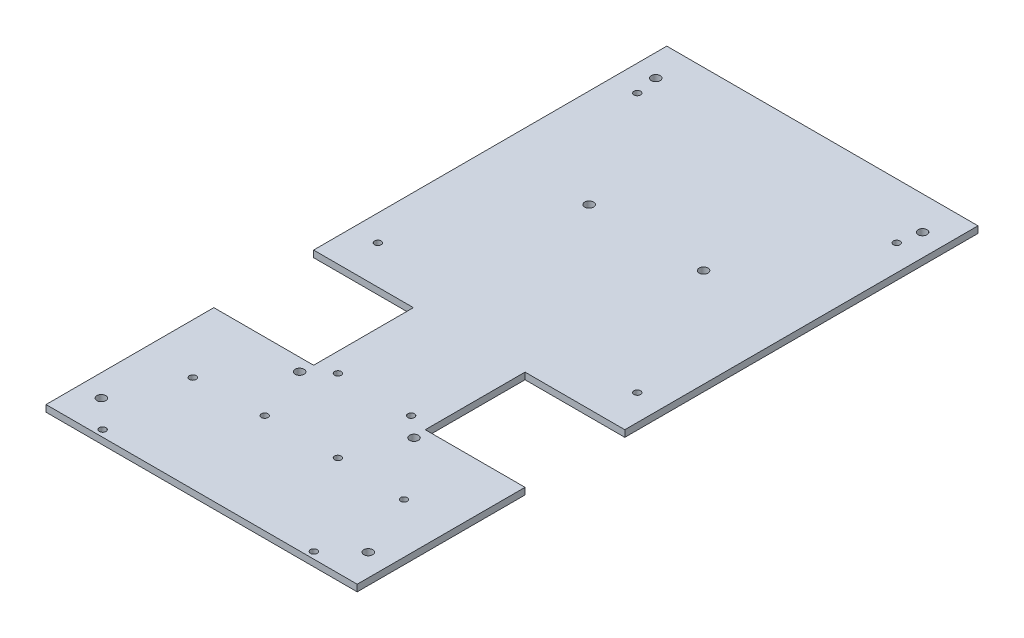
ISO-10303-21;
HEADER;
FILE_DESCRIPTION(('STEP AP214'),'2;1');
FILE_NAME('part.step','',(''),(''),'','','');
FILE_SCHEMA(('AUTOMOTIVE_DESIGN { 1 0 10303 214 1 1 1 1 }'));
ENDSEC;
DATA;
#1=APPLICATION_CONTEXT('core data for automotive mechanical design processes');
#2=APPLICATION_PROTOCOL_DEFINITION('international standard','automotive_design',2000,#1);
#3=PRODUCT_CONTEXT('',#1,'mechanical');
#4=PRODUCT('Part','Part','',(#3));
#5=PRODUCT_RELATED_PRODUCT_CATEGORY('part','',(#4));
#6=PRODUCT_DEFINITION_FORMATION('','',#4);
#7=PRODUCT_DEFINITION_CONTEXT('part definition',#1,'design');
#8=PRODUCT_DEFINITION('design','',#6,#7);
#9=PRODUCT_DEFINITION_SHAPE('','',#8);
#10=(LENGTH_UNIT() NAMED_UNIT(*) SI_UNIT(.MILLI.,.METRE.));
#11=(NAMED_UNIT(*) PLANE_ANGLE_UNIT() SI_UNIT($,.RADIAN.));
#12=(NAMED_UNIT(*) SI_UNIT($,.STERADIAN.) SOLID_ANGLE_UNIT());
#13=UNCERTAINTY_MEASURE_WITH_UNIT(LENGTH_MEASURE(1.E-05),#10,'distance_accuracy_value','');
#14=(GEOMETRIC_REPRESENTATION_CONTEXT(3) GLOBAL_UNCERTAINTY_ASSIGNED_CONTEXT((#13)) GLOBAL_UNIT_ASSIGNED_CONTEXT((#10,
#11,#12)) REPRESENTATION_CONTEXT('',''));
#15=CARTESIAN_POINT('',(0.,0.,0.));
#16=DIRECTION('',(0.,0.,1.));
#17=DIRECTION('',(1.,0.,0.));
#18=AXIS2_PLACEMENT_3D('',#15,#16,#17);
#19=CARTESIAN_POINT('',(0.,3.,0.));
#20=DIRECTION('',(0.,1.,0.));
#21=DIRECTION('',(0.,0.,1.));
#22=AXIS2_PLACEMENT_3D('',#19,#20,#21);
#23=PLANE('',#22);
#24=CARTESIAN_POINT('',(-74.2953937007874,3.,164.952755905512));
#25=DIRECTION('',(0.,1.,0.));
#26=DIRECTION('',(0.,0.,1.));
#27=AXIS2_PLACEMENT_3D('',#24,#25,#26);
#28=CIRCLE('',#27,1.5);
#29=CARTESIAN_POINT('',(-74.2953937007874,3.,166.452755905512));
#30=VERTEX_POINT('',#29);
#31=EDGE_CURVE('E363',#30,#30,#28,.T.);
#32=ORIENTED_EDGE('',*,*,#31,.F.);
#33=EDGE_LOOP('',(#32));
#34=FACE_BOUND('',#33,.T.);
#35=CARTESIAN_POINT('',(20.9546062992127,3.,164.952755905512));
#36=DIRECTION('',(0.,1.,0.));
#37=DIRECTION('',(0.,0.,1.));
#38=AXIS2_PLACEMENT_3D('',#35,#36,#37);
#39=CIRCLE('',#38,1.5);
#40=CARTESIAN_POINT('',(20.9546062992127,3.,166.452755905512));
#41=VERTEX_POINT('',#40);
#42=EDGE_CURVE('E357',#41,#41,#39,.T.);
#43=ORIENTED_EDGE('',*,*,#42,.F.);
#44=EDGE_LOOP('',(#43));
#45=FACE_BOUND('',#44,.T.);
#46=CARTESIAN_POINT('',(20.9546062992126,3.,124.312755905512));
#47=DIRECTION('',(0.,1.,0.));
#48=DIRECTION('',(0.,0.,1.));
#49=AXIS2_PLACEMENT_3D('',#46,#47,#48);
#50=CIRCLE('',#49,1.5);
#51=CARTESIAN_POINT('',(20.9546062992126,3.,125.812755905512));
#52=VERTEX_POINT('',#51);
#53=EDGE_CURVE('E351',#52,#52,#50,.T.);
#54=ORIENTED_EDGE('',*,*,#53,.F.);
#55=EDGE_LOOP('',(#54));
#56=FACE_BOUND('',#55,.T.);
#57=CARTESIAN_POINT('',(-74.2953937007874,3.,124.312755905512));
#58=DIRECTION('',(0.,1.,0.));
#59=DIRECTION('',(0.,0.,1.));
#60=AXIS2_PLACEMENT_3D('',#57,#58,#59);
#61=CIRCLE('',#60,1.5);
#62=CARTESIAN_POINT('',(-74.2953937007874,3.,125.812755905512));
#63=VERTEX_POINT('',#62);
#64=EDGE_CURVE('E345',#63,#63,#61,.T.);
#65=ORIENTED_EDGE('',*,*,#64,.F.);
#66=EDGE_LOOP('',(#65));
#67=FACE_BOUND('',#66,.T.);
#68=CARTESIAN_POINT('',(-52.4703937007874,3.,-32.6472440944882));
#69=DIRECTION('',(0.,1.,0.));
#70=DIRECTION('',(0.,0.,1.));
#71=AXIS2_PLACEMENT_3D('',#68,#69,#70);
#72=CIRCLE('',#71,2.);
#73=CARTESIAN_POINT('',(-52.4703937007874,3.,-30.6472440944882));
#74=VERTEX_POINT('',#73);
#75=EDGE_CURVE('E339',#74,#74,#72,.T.);
#76=ORIENTED_EDGE('',*,*,#75,.F.);
#77=EDGE_LOOP('',(#76));
#78=FACE_BOUND('',#77,.T.);
#79=CARTESIAN_POINT('',(-0.870393700787378,3.,-32.6472440944882));
#80=DIRECTION('',(0.,1.,0.));
#81=DIRECTION('',(0.,0.,1.));
#82=AXIS2_PLACEMENT_3D('',#79,#80,#81);
#83=CIRCLE('',#82,2.);
#84=CARTESIAN_POINT('',(-0.870393700787378,3.,-30.6472440944882));
#85=VERTEX_POINT('',#84);
#86=EDGE_CURVE('E333',#85,#85,#83,.T.);
#87=ORIENTED_EDGE('',*,*,#86,.F.);
#88=EDGE_LOOP('',(#87));
#89=FACE_BOUND('',#88,.T.);
#90=CARTESIAN_POINT('',(-43.1803937007874,3.,122.972755905512));
#91=DIRECTION('',(0.,1.,0.));
#92=DIRECTION('',(0.,0.,1.));
#93=AXIS2_PLACEMENT_3D('',#90,#91,#92);
#94=CIRCLE('',#93,1.5);
#95=CARTESIAN_POINT('',(-43.1803937007874,3.,124.472755905512));
#96=VERTEX_POINT('',#95);
#97=EDGE_CURVE('E327',#96,#96,#94,.T.);
#98=ORIENTED_EDGE('',*,*,#97,.F.);
#99=EDGE_LOOP('',(#98));
#100=FACE_BOUND('',#99,.T.);
#101=CARTESIAN_POINT('',(-10.1603937007874,3.,122.972755905512));
#102=DIRECTION('',(0.,1.,0.));
#103=DIRECTION('',(0.,0.,1.));
#104=AXIS2_PLACEMENT_3D('',#101,#102,#103);
#105=CIRCLE('',#104,1.5);
#106=CARTESIAN_POINT('',(-10.1603937007874,3.,124.472755905512));
#107=VERTEX_POINT('',#106);
#108=EDGE_CURVE('E321',#107,#107,#105,.T.);
#109=ORIENTED_EDGE('',*,*,#108,.F.);
#110=EDGE_LOOP('',(#109));
#111=FACE_BOUND('',#110,.T.);
#112=CARTESIAN_POINT('',(-10.1603937007874,3.,89.9527559055118));
#113=DIRECTION('',(0.,1.,0.));
#114=DIRECTION('',(0.,0.,1.));
#115=AXIS2_PLACEMENT_3D('',#112,#113,#114);
#116=CIRCLE('',#115,1.5);
#117=CARTESIAN_POINT('',(-10.1603937007874,3.,91.4527559055118));
#118=VERTEX_POINT('',#117);
#119=EDGE_CURVE('E315',#118,#118,#116,.T.);
#120=ORIENTED_EDGE('',*,*,#119,.F.);
#121=EDGE_LOOP('',(#120));
#122=FACE_BOUND('',#121,.T.);
#123=CARTESIAN_POINT('',(-43.1803937007874,3.,89.9527559055118));
#124=DIRECTION('',(0.,1.,0.));
#125=DIRECTION('',(0.,0.,1.));
#126=AXIS2_PLACEMENT_3D('',#123,#124,#125);
#127=CIRCLE('',#126,1.5);
#128=CARTESIAN_POINT('',(-43.1803937007874,3.,91.4527559055118));
#129=VERTEX_POINT('',#128);
#130=EDGE_CURVE('E309',#129,#129,#127,.T.);
#131=ORIENTED_EDGE('',*,*,#130,.F.);
#132=EDGE_LOOP('',(#131));
#133=FACE_BOUND('',#132,.T.);
#134=CARTESIAN_POINT('',(-0.870393700787356,3.,97.9527559055118));
#135=DIRECTION('',(0.,1.,0.));
#136=DIRECTION('',(0.,0.,1.));
#137=AXIS2_PLACEMENT_3D('',#134,#135,#136);
#138=CIRCLE('',#137,2.);
#139=CARTESIAN_POINT('',(-0.870393700787356,3.,99.9527559055118));
#140=VERTEX_POINT('',#139);
#141=EDGE_CURVE('E303',#140,#140,#138,.T.);
#142=ORIENTED_EDGE('',*,*,#141,.F.);
#143=EDGE_LOOP('',(#142));
#144=FACE_BOUND('',#143,.T.);
#145=CARTESIAN_POINT('',(-52.4703937007874,3.,97.9527559055118));
#146=DIRECTION('',(0.,1.,0.));
#147=DIRECTION('',(0.,0.,1.));
#148=AXIS2_PLACEMENT_3D('',#145,#146,#147);
#149=CIRCLE('',#148,2.);
#150=CARTESIAN_POINT('',(-52.4703937007874,3.,99.9527559055118));
#151=VERTEX_POINT('',#150);
#152=EDGE_CURVE('E297',#151,#151,#149,.T.);
#153=ORIENTED_EDGE('',*,*,#152,.F.);
#154=EDGE_LOOP('',(#153));
#155=FACE_BOUND('',#154,.T.);
#156=CARTESIAN_POINT('',(31.8296062992126,3.,-87.0472440944882));
#157=DIRECTION('',(0.,1.,0.));
#158=DIRECTION('',(0.,0.,1.));
#159=AXIS2_PLACEMENT_3D('',#156,#157,#158);
#160=CIRCLE('',#159,1.5);
#161=CARTESIAN_POINT('',(31.8296062992126,3.,-85.5472440944882));
#162=VERTEX_POINT('',#161);
#163=EDGE_CURVE('E291',#162,#162,#160,.T.);
#164=ORIENTED_EDGE('',*,*,#163,.F.);
#165=EDGE_LOOP('',(#164));
#166=FACE_BOUND('',#165,.T.);
#167=CARTESIAN_POINT('',(31.8296062992126,3.,29.9527559055118));
#168=DIRECTION('',(0.,1.,0.));
#169=DIRECTION('',(0.,0.,1.));
#170=AXIS2_PLACEMENT_3D('',#167,#168,#169);
#171=CIRCLE('',#170,1.5);
#172=CARTESIAN_POINT('',(31.8296062992126,3.,31.4527559055118));
#173=VERTEX_POINT('',#172);
#174=EDGE_CURVE('E285',#173,#173,#171,.T.);
#175=ORIENTED_EDGE('',*,*,#174,.F.);
#176=EDGE_LOOP('',(#175));
#177=FACE_BOUND('',#176,.T.);
#178=CARTESIAN_POINT('',(-85.1703937007874,3.,29.9527559055118));
#179=DIRECTION('',(0.,1.,0.));
#180=DIRECTION('',(0.,0.,1.));
#181=AXIS2_PLACEMENT_3D('',#178,#179,#180);
#182=CIRCLE('',#181,1.5);
#183=CARTESIAN_POINT('',(-85.1703937007874,3.,31.4527559055118));
#184=VERTEX_POINT('',#183);
#185=EDGE_CURVE('E280',#184,#184,#182,.T.);
#186=ORIENTED_EDGE('',*,*,#185,.F.);
#187=EDGE_LOOP('',(#186));
#188=FACE_BOUND('',#187,.T.);
#189=CARTESIAN_POINT('',(-85.1703937007874,3.,-87.0472440944882));
#190=DIRECTION('',(0.,1.,0.));
#191=DIRECTION('',(0.,0.,1.));
#192=AXIS2_PLACEMENT_3D('',#189,#190,#191);
#193=CIRCLE('',#192,1.5);
#194=CARTESIAN_POINT('',(-85.1703937007874,3.,-85.5472440944882));
#195=VERTEX_POINT('',#194);
#196=EDGE_CURVE('E185',#195,#195,#193,.T.);
#197=ORIENTED_EDGE('',*,*,#196,.F.);
#198=EDGE_LOOP('',(#197));
#199=FACE_BOUND('',#198,.T.);
#200=CARTESIAN_POINT('',(33.5096062992126,3.,-97.0472440944882));
#201=DIRECTION('',(0.,1.,0.));
#202=DIRECTION('',(0.,0.,1.));
#203=AXIS2_PLACEMENT_3D('',#200,#201,#202);
#204=CIRCLE('',#203,2.);
#205=CARTESIAN_POINT('',(33.5096062992126,3.,-95.0472440944882));
#206=VERTEX_POINT('',#205);
#207=EDGE_CURVE('E221',#206,#206,#204,.T.);
#208=ORIENTED_EDGE('',*,*,#207,.F.);
#209=EDGE_LOOP('',(#208));
#210=FACE_BOUND('',#209,.T.);
#211=CARTESIAN_POINT('',(-86.8503937007874,3.,-97.0472440944882));
#212=DIRECTION('',(0.,1.,0.));
#213=DIRECTION('',(0.,0.,-1.));
#214=AXIS2_PLACEMENT_3D('',#211,#212,#213);
#215=CIRCLE('',#214,2.);
#216=CARTESIAN_POINT('',(-86.8503937007874,3.,-99.0472440944882));
#217=VERTEX_POINT('',#216);
#218=EDGE_CURVE('E225',#217,#217,#215,.T.);
#219=ORIENTED_EDGE('',*,*,#218,.F.);
#220=EDGE_LOOP('',(#219));
#221=FACE_BOUND('',#220,.T.);
#222=CARTESIAN_POINT('',(33.5096062992126,3.,152.952755905512));
#223=DIRECTION('',(0.,1.,0.));
#224=DIRECTION('',(0.,0.,-1.));
#225=AXIS2_PLACEMENT_3D('',#222,#223,#224);
#226=CIRCLE('',#225,2.);
#227=CARTESIAN_POINT('',(33.5096062992126,3.,150.952755905512));
#228=VERTEX_POINT('',#227);
#229=EDGE_CURVE('E231',#228,#228,#226,.T.);
#230=ORIENTED_EDGE('',*,*,#229,.F.);
#231=EDGE_LOOP('',(#230));
#232=FACE_BOUND('',#231,.T.);
#233=CARTESIAN_POINT('',(-86.8503937007874,3.,152.952755905512));
#234=DIRECTION('',(0.,1.,0.));
#235=DIRECTION('',(0.,0.,1.));
#236=AXIS2_PLACEMENT_3D('',#233,#234,#235);
#237=CIRCLE('',#236,2.);
#238=CARTESIAN_POINT('',(-86.8503937007874,3.,154.952755905512));
#239=VERTEX_POINT('',#238);
#240=EDGE_CURVE('E237',#239,#239,#237,.T.);
#241=ORIENTED_EDGE('',*,*,#240,.F.);
#242=EDGE_LOOP('',(#241));
#243=FACE_BOUND('',#242,.T.);
#244=DIRECTION('',(0.,0.,-1.));
#245=VECTOR('',#244,1.);
#246=CARTESIAN_POINT('',(43.5096062992126,3.,-112.047244094488));
#247=LINE('',#246,#245);
#248=CARTESIAN_POINT('',(43.5096062992126,3.,167.952755905512));
#249=VERTEX_POINT('',#248);
#250=CARTESIAN_POINT('',(43.5096062992126,3.,92.2527559055118));
#251=VERTEX_POINT('',#250);
#252=EDGE_CURVE('E145',#249,#251,#247,.T.);
#253=ORIENTED_EDGE('',*,*,#252,.T.);
#254=DIRECTION('',(1.,0.,0.));
#255=VECTOR('',#254,1.);
#256=CARTESIAN_POINT('',(43.5096062992126,3.,92.2527559055118));
#257=LINE('',#256,#255);
#258=CARTESIAN_POINT('',(-1.49039370078735,3.,92.2527559055118));
#259=VERTEX_POINT('',#258);
#260=EDGE_CURVE('E127',#259,#251,#257,.T.);
#261=ORIENTED_EDGE('',*,*,#260,.F.);
#262=DIRECTION('',(0.,0.,1.));
#263=VECTOR('',#262,1.);
#264=CARTESIAN_POINT('',(-1.49039370078735,3.,92.2527559055118));
#265=LINE('',#264,#263);
#266=CARTESIAN_POINT('',(-1.49039370078737,3.,47.2527559055118));
#267=VERTEX_POINT('',#266);
#268=EDGE_CURVE('E192',#267,#259,#265,.T.);
#269=ORIENTED_EDGE('',*,*,#268,.F.);
#270=DIRECTION('',(-1.,0.,0.));
#271=VECTOR('',#270,1.);
#272=CARTESIAN_POINT('',(43.5096062992126,3.,47.2527559055118));
#273=LINE('',#272,#271);
#274=CARTESIAN_POINT('',(43.5096062992126,3.,47.2527559055118));
#275=VERTEX_POINT('',#274);
#276=EDGE_CURVE('E137',#275,#267,#273,.T.);
#277=ORIENTED_EDGE('',*,*,#276,.F.);
#278=CARTESIAN_POINT('',(43.5096062992126,3.,-112.047244094488));
#279=VERTEX_POINT('',#278);
#280=EDGE_CURVE('E155',#275,#279,#247,.T.);
#281=ORIENTED_EDGE('',*,*,#280,.T.);
#282=DIRECTION('',(-1.,0.,0.));
#283=VECTOR('',#282,1.);
#284=CARTESIAN_POINT('',(-96.8503937007874,3.,-112.047244094488));
#285=LINE('',#284,#283);
#286=CARTESIAN_POINT('',(-96.8503937007874,3.,-112.047244094488));
#287=VERTEX_POINT('',#286);
#288=EDGE_CURVE('E154',#279,#287,#285,.T.);
#289=ORIENTED_EDGE('',*,*,#288,.T.);
#290=DIRECTION('',(0.,0.,1.));
#291=VECTOR('',#290,1.);
#292=CARTESIAN_POINT('',(-96.8503937007874,3.,-112.047244094488));
#293=LINE('',#292,#291);
#294=CARTESIAN_POINT('',(-96.8503937007874,3.,47.2527559055118));
#295=VERTEX_POINT('',#294);
#296=EDGE_CURVE('E244',#287,#295,#293,.T.);
#297=ORIENTED_EDGE('',*,*,#296,.T.);
#298=DIRECTION('',(-1.,0.,0.));
#299=VECTOR('',#298,1.);
#300=CARTESIAN_POINT('',(-96.8503937007874,3.,47.2527559055118));
#301=LINE('',#300,#299);
#302=CARTESIAN_POINT('',(-51.8503937007874,3.,47.2527559055118));
#303=VERTEX_POINT('',#302);
#304=EDGE_CURVE('E205',#303,#295,#301,.T.);
#305=ORIENTED_EDGE('',*,*,#304,.F.);
#306=DIRECTION('',(0.,0.,-1.));
#307=VECTOR('',#306,1.);
#308=CARTESIAN_POINT('',(-51.8503937007874,3.,92.2527559055118));
#309=LINE('',#308,#307);
#310=CARTESIAN_POINT('',(-51.8503937007874,3.,92.2527559055118));
#311=VERTEX_POINT('',#310);
#312=EDGE_CURVE('E202',#311,#303,#309,.T.);
#313=ORIENTED_EDGE('',*,*,#312,.F.);
#314=DIRECTION('',(1.,0.,0.));
#315=VECTOR('',#314,1.);
#316=CARTESIAN_POINT('',(-96.8503937007874,3.,92.2527559055118));
#317=LINE('',#316,#315);
#318=CARTESIAN_POINT('',(-96.8503937007874,3.,92.2527559055118));
#319=VERTEX_POINT('',#318);
#320=EDGE_CURVE('E200',#319,#311,#317,.T.);
#321=ORIENTED_EDGE('',*,*,#320,.F.);
#322=CARTESIAN_POINT('',(-96.8503937007874,3.,167.952755905512));
#323=VERTEX_POINT('',#322);
#324=EDGE_CURVE('E172',#319,#323,#293,.T.);
#325=ORIENTED_EDGE('',*,*,#324,.T.);
#326=DIRECTION('',(1.,0.,0.));
#327=VECTOR('',#326,1.);
#328=CARTESIAN_POINT('',(-96.8503937007874,3.,167.952755905512));
#329=LINE('',#328,#327);
#330=EDGE_CURVE('E152',#323,#249,#329,.T.);
#331=ORIENTED_EDGE('',*,*,#330,.T.);
#332=EDGE_LOOP('',(#253,#261,#269,#277,#281,#289,#297,#305,#313,#321,#325,#331));
#333=FACE_BOUND('',#332,.T.);
#334=ADVANCED_FACE('F37',(#34,#45,#56,#67,#78,#89,#100,#111,#122,#133,#144,#155,#166,#177,#188,
#199,#210,#221,#232,#243,#333),#23,.T.);
#335=CARTESIAN_POINT('',(0.,0.,0.));
#336=DIRECTION('',(0.,1.,0.));
#337=DIRECTION('',(0.,0.,1.));
#338=AXIS2_PLACEMENT_3D('',#335,#336,#337);
#339=PLANE('',#338);
#340=CARTESIAN_POINT('',(-74.2953937007874,0.,164.952755905512));
#341=DIRECTION('',(0.,1.,0.));
#342=DIRECTION('',(0.,0.,1.));
#343=AXIS2_PLACEMENT_3D('',#340,#341,#342);
#344=CIRCLE('',#343,1.5);
#345=CARTESIAN_POINT('',(-74.2953937007874,0.,166.452755905512));
#346=VERTEX_POINT('',#345);
#347=EDGE_CURVE('E366',#346,#346,#344,.T.);
#348=ORIENTED_EDGE('',*,*,#347,.T.);
#349=EDGE_LOOP('',(#348));
#350=FACE_BOUND('',#349,.T.);
#351=CARTESIAN_POINT('',(20.9546062992127,0.,164.952755905512));
#352=DIRECTION('',(0.,1.,0.));
#353=DIRECTION('',(0.,0.,1.));
#354=AXIS2_PLACEMENT_3D('',#351,#352,#353);
#355=CIRCLE('',#354,1.5);
#356=CARTESIAN_POINT('',(20.9546062992127,0.,166.452755905512));
#357=VERTEX_POINT('',#356);
#358=EDGE_CURVE('E360',#357,#357,#355,.T.);
#359=ORIENTED_EDGE('',*,*,#358,.T.);
#360=EDGE_LOOP('',(#359));
#361=FACE_BOUND('',#360,.T.);
#362=CARTESIAN_POINT('',(20.9546062992126,0.,124.312755905512));
#363=DIRECTION('',(0.,1.,0.));
#364=DIRECTION('',(0.,0.,1.));
#365=AXIS2_PLACEMENT_3D('',#362,#363,#364);
#366=CIRCLE('',#365,1.5);
#367=CARTESIAN_POINT('',(20.9546062992126,0.,125.812755905512));
#368=VERTEX_POINT('',#367);
#369=EDGE_CURVE('E354',#368,#368,#366,.T.);
#370=ORIENTED_EDGE('',*,*,#369,.T.);
#371=EDGE_LOOP('',(#370));
#372=FACE_BOUND('',#371,.T.);
#373=CARTESIAN_POINT('',(-74.2953937007874,0.,124.312755905512));
#374=DIRECTION('',(0.,1.,0.));
#375=DIRECTION('',(0.,0.,1.));
#376=AXIS2_PLACEMENT_3D('',#373,#374,#375);
#377=CIRCLE('',#376,1.5);
#378=CARTESIAN_POINT('',(-74.2953937007874,0.,125.812755905512));
#379=VERTEX_POINT('',#378);
#380=EDGE_CURVE('E348',#379,#379,#377,.T.);
#381=ORIENTED_EDGE('',*,*,#380,.T.);
#382=EDGE_LOOP('',(#381));
#383=FACE_BOUND('',#382,.T.);
#384=CARTESIAN_POINT('',(-52.4703937007874,0.,-32.6472440944882));
#385=DIRECTION('',(0.,1.,0.));
#386=DIRECTION('',(0.,0.,1.));
#387=AXIS2_PLACEMENT_3D('',#384,#385,#386);
#388=CIRCLE('',#387,2.);
#389=CARTESIAN_POINT('',(-52.4703937007874,0.,-30.6472440944882));
#390=VERTEX_POINT('',#389);
#391=EDGE_CURVE('E342',#390,#390,#388,.T.);
#392=ORIENTED_EDGE('',*,*,#391,.T.);
#393=EDGE_LOOP('',(#392));
#394=FACE_BOUND('',#393,.T.);
#395=CARTESIAN_POINT('',(-0.870393700787378,0.,-32.6472440944882));
#396=DIRECTION('',(0.,1.,0.));
#397=DIRECTION('',(0.,0.,1.));
#398=AXIS2_PLACEMENT_3D('',#395,#396,#397);
#399=CIRCLE('',#398,2.);
#400=CARTESIAN_POINT('',(-0.870393700787378,0.,-30.6472440944882));
#401=VERTEX_POINT('',#400);
#402=EDGE_CURVE('E336',#401,#401,#399,.T.);
#403=ORIENTED_EDGE('',*,*,#402,.T.);
#404=EDGE_LOOP('',(#403));
#405=FACE_BOUND('',#404,.T.);
#406=CARTESIAN_POINT('',(-43.1803937007874,0.,122.972755905512));
#407=DIRECTION('',(0.,1.,0.));
#408=DIRECTION('',(0.,0.,1.));
#409=AXIS2_PLACEMENT_3D('',#406,#407,#408);
#410=CIRCLE('',#409,1.5);
#411=CARTESIAN_POINT('',(-43.1803937007874,0.,124.472755905512));
#412=VERTEX_POINT('',#411);
#413=EDGE_CURVE('E330',#412,#412,#410,.T.);
#414=ORIENTED_EDGE('',*,*,#413,.T.);
#415=EDGE_LOOP('',(#414));
#416=FACE_BOUND('',#415,.T.);
#417=CARTESIAN_POINT('',(-10.1603937007874,0.,122.972755905512));
#418=DIRECTION('',(0.,1.,0.));
#419=DIRECTION('',(0.,0.,1.));
#420=AXIS2_PLACEMENT_3D('',#417,#418,#419);
#421=CIRCLE('',#420,1.5);
#422=CARTESIAN_POINT('',(-10.1603937007874,0.,124.472755905512));
#423=VERTEX_POINT('',#422);
#424=EDGE_CURVE('E324',#423,#423,#421,.T.);
#425=ORIENTED_EDGE('',*,*,#424,.T.);
#426=EDGE_LOOP('',(#425));
#427=FACE_BOUND('',#426,.T.);
#428=CARTESIAN_POINT('',(-10.1603937007874,0.,89.9527559055118));
#429=DIRECTION('',(0.,1.,0.));
#430=DIRECTION('',(0.,0.,1.));
#431=AXIS2_PLACEMENT_3D('',#428,#429,#430);
#432=CIRCLE('',#431,1.5);
#433=CARTESIAN_POINT('',(-10.1603937007874,0.,91.4527559055118));
#434=VERTEX_POINT('',#433);
#435=EDGE_CURVE('E318',#434,#434,#432,.T.);
#436=ORIENTED_EDGE('',*,*,#435,.T.);
#437=EDGE_LOOP('',(#436));
#438=FACE_BOUND('',#437,.T.);
#439=CARTESIAN_POINT('',(-43.1803937007874,0.,89.9527559055118));
#440=DIRECTION('',(0.,1.,0.));
#441=DIRECTION('',(0.,0.,1.));
#442=AXIS2_PLACEMENT_3D('',#439,#440,#441);
#443=CIRCLE('',#442,1.5);
#444=CARTESIAN_POINT('',(-43.1803937007874,0.,91.4527559055118));
#445=VERTEX_POINT('',#444);
#446=EDGE_CURVE('E312',#445,#445,#443,.T.);
#447=ORIENTED_EDGE('',*,*,#446,.T.);
#448=EDGE_LOOP('',(#447));
#449=FACE_BOUND('',#448,.T.);
#450=CARTESIAN_POINT('',(-0.870393700787356,0.,97.9527559055118));
#451=DIRECTION('',(0.,1.,0.));
#452=DIRECTION('',(0.,0.,1.));
#453=AXIS2_PLACEMENT_3D('',#450,#451,#452);
#454=CIRCLE('',#453,2.);
#455=CARTESIAN_POINT('',(-0.870393700787356,0.,99.9527559055118));
#456=VERTEX_POINT('',#455);
#457=EDGE_CURVE('E306',#456,#456,#454,.T.);
#458=ORIENTED_EDGE('',*,*,#457,.T.);
#459=EDGE_LOOP('',(#458));
#460=FACE_BOUND('',#459,.T.);
#461=CARTESIAN_POINT('',(-52.4703937007874,0.,97.9527559055118));
#462=DIRECTION('',(0.,1.,0.));
#463=DIRECTION('',(0.,0.,1.));
#464=AXIS2_PLACEMENT_3D('',#461,#462,#463);
#465=CIRCLE('',#464,2.);
#466=CARTESIAN_POINT('',(-52.4703937007874,0.,99.9527559055118));
#467=VERTEX_POINT('',#466);
#468=EDGE_CURVE('E300',#467,#467,#465,.T.);
#469=ORIENTED_EDGE('',*,*,#468,.T.);
#470=EDGE_LOOP('',(#469));
#471=FACE_BOUND('',#470,.T.);
#472=CARTESIAN_POINT('',(31.8296062992126,0.,-87.0472440944882));
#473=DIRECTION('',(0.,1.,0.));
#474=DIRECTION('',(0.,0.,1.));
#475=AXIS2_PLACEMENT_3D('',#472,#473,#474);
#476=CIRCLE('',#475,1.5);
#477=CARTESIAN_POINT('',(31.8296062992126,0.,-85.5472440944882));
#478=VERTEX_POINT('',#477);
#479=EDGE_CURVE('E294',#478,#478,#476,.T.);
#480=ORIENTED_EDGE('',*,*,#479,.T.);
#481=EDGE_LOOP('',(#480));
#482=FACE_BOUND('',#481,.T.);
#483=CARTESIAN_POINT('',(31.8296062992126,0.,29.9527559055118));
#484=DIRECTION('',(0.,1.,0.));
#485=DIRECTION('',(0.,0.,1.));
#486=AXIS2_PLACEMENT_3D('',#483,#484,#485);
#487=CIRCLE('',#486,1.5);
#488=CARTESIAN_POINT('',(31.8296062992126,0.,31.4527559055118));
#489=VERTEX_POINT('',#488);
#490=EDGE_CURVE('E288',#489,#489,#487,.T.);
#491=ORIENTED_EDGE('',*,*,#490,.T.);
#492=EDGE_LOOP('',(#491));
#493=FACE_BOUND('',#492,.T.);
#494=CARTESIAN_POINT('',(-85.1703937007874,0.,29.9527559055118));
#495=DIRECTION('',(0.,1.,0.));
#496=DIRECTION('',(0.,0.,1.));
#497=AXIS2_PLACEMENT_3D('',#494,#495,#496);
#498=CIRCLE('',#497,1.5);
#499=CARTESIAN_POINT('',(-85.1703937007874,0.,31.4527559055118));
#500=VERTEX_POINT('',#499);
#501=EDGE_CURVE('E282',#500,#500,#498,.T.);
#502=ORIENTED_EDGE('',*,*,#501,.T.);
#503=EDGE_LOOP('',(#502));
#504=FACE_BOUND('',#503,.T.);
#505=CARTESIAN_POINT('',(-85.1703937007874,0.,-87.0472440944882));
#506=DIRECTION('',(0.,1.,0.));
#507=DIRECTION('',(0.,0.,1.));
#508=AXIS2_PLACEMENT_3D('',#505,#506,#507);
#509=CIRCLE('',#508,1.5);
#510=CARTESIAN_POINT('',(-85.1703937007874,0.,-85.5472440944882));
#511=VERTEX_POINT('',#510);
#512=EDGE_CURVE('E189',#511,#511,#509,.T.);
#513=ORIENTED_EDGE('',*,*,#512,.T.);
#514=EDGE_LOOP('',(#513));
#515=FACE_BOUND('',#514,.T.);
#516=CARTESIAN_POINT('',(33.5096062992126,0.,-97.0472440944882));
#517=DIRECTION('',(0.,1.,0.));
#518=DIRECTION('',(0.,0.,1.));
#519=AXIS2_PLACEMENT_3D('',#516,#517,#518);
#520=CIRCLE('',#519,2.);
#521=CARTESIAN_POINT('',(33.5096062992126,0.,-95.0472440944882));
#522=VERTEX_POINT('',#521);
#523=EDGE_CURVE('E222',#522,#522,#520,.T.);
#524=ORIENTED_EDGE('',*,*,#523,.T.);
#525=EDGE_LOOP('',(#524));
#526=FACE_BOUND('',#525,.T.);
#527=CARTESIAN_POINT('',(-86.8503937007874,0.,-97.0472440944882));
#528=DIRECTION('',(0.,1.,0.));
#529=DIRECTION('',(0.,0.,-1.));
#530=AXIS2_PLACEMENT_3D('',#527,#528,#529);
#531=CIRCLE('',#530,2.);
#532=CARTESIAN_POINT('',(-86.8503937007874,0.,-99.0472440944882));
#533=VERTEX_POINT('',#532);
#534=EDGE_CURVE('E228',#533,#533,#531,.T.);
#535=ORIENTED_EDGE('',*,*,#534,.T.);
#536=EDGE_LOOP('',(#535));
#537=FACE_BOUND('',#536,.T.);
#538=CARTESIAN_POINT('',(33.5096062992126,0.,152.952755905512));
#539=DIRECTION('',(0.,1.,0.));
#540=DIRECTION('',(0.,0.,-1.));
#541=AXIS2_PLACEMENT_3D('',#538,#539,#540);
#542=CIRCLE('',#541,2.);
#543=CARTESIAN_POINT('',(33.5096062992126,0.,150.952755905512));
#544=VERTEX_POINT('',#543);
#545=EDGE_CURVE('E234',#544,#544,#542,.T.);
#546=ORIENTED_EDGE('',*,*,#545,.T.);
#547=EDGE_LOOP('',(#546));
#548=FACE_BOUND('',#547,.T.);
#549=CARTESIAN_POINT('',(-86.8503937007874,0.,152.952755905512));
#550=DIRECTION('',(0.,1.,0.));
#551=DIRECTION('',(0.,0.,1.));
#552=AXIS2_PLACEMENT_3D('',#549,#550,#551);
#553=CIRCLE('',#552,2.);
#554=CARTESIAN_POINT('',(-86.8503937007874,0.,154.952755905512));
#555=VERTEX_POINT('',#554);
#556=EDGE_CURVE('E240',#555,#555,#553,.T.);
#557=ORIENTED_EDGE('',*,*,#556,.T.);
#558=EDGE_LOOP('',(#557));
#559=FACE_BOUND('',#558,.T.);
#560=DIRECTION('',(1.,0.,0.));
#561=VECTOR('',#560,1.);
#562=CARTESIAN_POINT('',(43.5096062992126,0.,92.2527559055118));
#563=LINE('',#562,#561);
#564=CARTESIAN_POINT('',(-1.49039370078735,0.,92.2527559055118));
#565=VERTEX_POINT('',#564);
#566=CARTESIAN_POINT('',(43.5096062992126,0.,92.2527559055118));
#567=VERTEX_POINT('',#566);
#568=EDGE_CURVE('E183',#565,#567,#563,.T.);
#569=ORIENTED_EDGE('',*,*,#568,.T.);
#570=DIRECTION('',(0.,0.,-1.));
#571=VECTOR('',#570,1.);
#572=CARTESIAN_POINT('',(43.5096062992126,0.,-112.047244094488));
#573=LINE('',#572,#571);
#574=CARTESIAN_POINT('',(43.5096062992126,0.,167.952755905512));
#575=VERTEX_POINT('',#574);
#576=EDGE_CURVE('E147',#575,#567,#573,.T.);
#577=ORIENTED_EDGE('',*,*,#576,.F.);
#578=DIRECTION('',(1.,0.,0.));
#579=VECTOR('',#578,1.);
#580=CARTESIAN_POINT('',(-96.8503937007874,0.,167.952755905512));
#581=LINE('',#580,#579);
#582=CARTESIAN_POINT('',(-96.8503937007874,0.,167.952755905512));
#583=VERTEX_POINT('',#582);
#584=EDGE_CURVE('E165',#583,#575,#581,.T.);
#585=ORIENTED_EDGE('',*,*,#584,.F.);
#586=DIRECTION('',(0.,0.,1.));
#587=VECTOR('',#586,1.);
#588=CARTESIAN_POINT('',(-96.8503937007874,0.,-112.047244094488));
#589=LINE('',#588,#587);
#590=CARTESIAN_POINT('',(-96.8503937007874,0.,92.2527559055118));
#591=VERTEX_POINT('',#590);
#592=EDGE_CURVE('E166',#591,#583,#589,.T.);
#593=ORIENTED_EDGE('',*,*,#592,.F.);
#594=DIRECTION('',(1.,0.,0.));
#595=VECTOR('',#594,1.);
#596=CARTESIAN_POINT('',(-96.8503937007874,0.,92.2527559055118));
#597=LINE('',#596,#595);
#598=CARTESIAN_POINT('',(-51.8503937007874,0.,92.2527559055118));
#599=VERTEX_POINT('',#598);
#600=EDGE_CURVE('E148',#591,#599,#597,.T.);
#601=ORIENTED_EDGE('',*,*,#600,.T.);
#602=DIRECTION('',(0.,0.,-1.));
#603=VECTOR('',#602,1.);
#604=CARTESIAN_POINT('',(-51.8503937007874,0.,92.2527559055118));
#605=LINE('',#604,#603);
#606=CARTESIAN_POINT('',(-51.8503937007874,0.,47.2527559055118));
#607=VERTEX_POINT('',#606);
#608=EDGE_CURVE('E209',#599,#607,#605,.T.);
#609=ORIENTED_EDGE('',*,*,#608,.T.);
#610=DIRECTION('',(-1.,0.,0.));
#611=VECTOR('',#610,1.);
#612=CARTESIAN_POINT('',(-96.8503937007874,0.,47.2527559055118));
#613=LINE('',#612,#611);
#614=CARTESIAN_POINT('',(-96.8503937007874,0.,47.2527559055118));
#615=VERTEX_POINT('',#614);
#616=EDGE_CURVE('E203',#607,#615,#613,.T.);
#617=ORIENTED_EDGE('',*,*,#616,.T.);
#618=CARTESIAN_POINT('',(-96.8503937007874,0.,-112.047244094488));
#619=VERTEX_POINT('',#618);
#620=EDGE_CURVE('E162',#619,#615,#589,.T.);
#621=ORIENTED_EDGE('',*,*,#620,.F.);
#622=DIRECTION('',(-1.,0.,0.));
#623=VECTOR('',#622,1.);
#624=CARTESIAN_POINT('',(-96.8503937007874,0.,-112.047244094488));
#625=LINE('',#624,#623);
#626=CARTESIAN_POINT('',(43.5096062992126,0.,-112.047244094488));
#627=VERTEX_POINT('',#626);
#628=EDGE_CURVE('E170',#627,#619,#625,.T.);
#629=ORIENTED_EDGE('',*,*,#628,.F.);
#630=CARTESIAN_POINT('',(43.5096062992126,0.,47.2527559055118));
#631=VERTEX_POINT('',#630);
#632=EDGE_CURVE('E168',#631,#627,#573,.T.);
#633=ORIENTED_EDGE('',*,*,#632,.F.);
#634=DIRECTION('',(-1.,0.,0.));
#635=VECTOR('',#634,1.);
#636=CARTESIAN_POINT('',(43.5096062992126,0.,47.2527559055118));
#637=LINE('',#636,#635);
#638=CARTESIAN_POINT('',(-1.49039370078737,0.,47.2527559055118));
#639=VERTEX_POINT('',#638);
#640=EDGE_CURVE('E52',#631,#639,#637,.T.);
#641=ORIENTED_EDGE('',*,*,#640,.T.);
#642=DIRECTION('',(0.,0.,1.));
#643=VECTOR('',#642,1.);
#644=CARTESIAN_POINT('',(-1.49039370078735,0.,92.2527559055118));
#645=LINE('',#644,#643);
#646=EDGE_CURVE('E138',#639,#565,#645,.T.);
#647=ORIENTED_EDGE('',*,*,#646,.T.);
#648=EDGE_LOOP('',(#569,#577,#585,#593,#601,#609,#617,#621,#629,#633,#641,#647));
#649=FACE_BOUND('',#648,.T.);
#650=ADVANCED_FACE('F180',(#350,#361,#372,#383,#394,#405,#416,#427,#438,#449,#460,#471,#482,
#493,#504,#515,#526,#537,#548,#559,#649),#339,.F.);
#651=CARTESIAN_POINT('',(43.5096062992126,3.,-112.047244094488));
#652=DIRECTION('',(-1.,0.,0.));
#653=DIRECTION('',(0.,0.,1.));
#654=AXIS2_PLACEMENT_3D('',#651,#652,#653);
#655=PLANE('',#654);
#656=DIRECTION('',(0.,-1.,0.));
#657=VECTOR('',#656,1.);
#658=CARTESIAN_POINT('',(43.5096062992126,3.,92.2527559055118));
#659=LINE('',#658,#657);
#660=EDGE_CURVE('E131',#251,#567,#659,.T.);
#661=ORIENTED_EDGE('',*,*,#660,.F.);
#662=ORIENTED_EDGE('',*,*,#252,.F.);
#663=DIRECTION('',(0.,-1.,0.));
#664=VECTOR('',#663,1.);
#665=CARTESIAN_POINT('',(43.5096062992126,3.,167.952755905512));
#666=LINE('',#665,#664);
#667=EDGE_CURVE('E45',#249,#575,#666,.T.);
#668=ORIENTED_EDGE('',*,*,#667,.T.);
#669=ORIENTED_EDGE('',*,*,#576,.T.);
#670=EDGE_LOOP('',(#661,#662,#668,#669));
#671=FACE_BOUND('',#670,.T.);
#672=ADVANCED_FACE('F143',(#671),#655,.F.);
#673=DIRECTION('',(0.,-1.,0.));
#674=VECTOR('',#673,1.);
#675=CARTESIAN_POINT('',(43.5096062992126,3.,47.2527559055118));
#676=LINE('',#675,#674);
#677=EDGE_CURVE('E149',#275,#631,#676,.T.);
#678=ORIENTED_EDGE('',*,*,#677,.T.);
#679=ORIENTED_EDGE('',*,*,#632,.T.);
#680=DIRECTION('',(0.,-1.,0.));
#681=VECTOR('',#680,1.);
#682=CARTESIAN_POINT('',(43.5096062992126,3.,-112.047244094488));
#683=LINE('',#682,#681);
#684=EDGE_CURVE('E175',#279,#627,#683,.T.);
#685=ORIENTED_EDGE('',*,*,#684,.F.);
#686=ORIENTED_EDGE('',*,*,#280,.F.);
#687=EDGE_LOOP('',(#678,#679,#685,#686));
#688=FACE_BOUND('',#687,.T.);
#689=ADVANCED_FACE('F273',(#688),#655,.F.);
#690=CARTESIAN_POINT('',(-96.8503937007874,3.,-112.047244094488));
#691=DIRECTION('',(1.,0.,0.));
#692=DIRECTION('',(0.,0.,-1.));
#693=AXIS2_PLACEMENT_3D('',#690,#691,#692);
#694=PLANE('',#693);
#695=DIRECTION('',(0.,-1.,0.));
#696=VECTOR('',#695,1.);
#697=CARTESIAN_POINT('',(-96.8503937007874,3.,92.2527559055118));
#698=LINE('',#697,#696);
#699=EDGE_CURVE('E218',#319,#591,#698,.T.);
#700=ORIENTED_EDGE('',*,*,#699,.T.);
#701=ORIENTED_EDGE('',*,*,#592,.T.);
#702=DIRECTION('',(0.,-1.,0.));
#703=VECTOR('',#702,1.);
#704=CARTESIAN_POINT('',(-96.8503937007874,3.,167.952755905512));
#705=LINE('',#704,#703);
#706=EDGE_CURVE('E11',#323,#583,#705,.T.);
#707=ORIENTED_EDGE('',*,*,#706,.F.);
#708=ORIENTED_EDGE('',*,*,#324,.F.);
#709=EDGE_LOOP('',(#700,#701,#707,#708));
#710=FACE_BOUND('',#709,.T.);
#711=ADVANCED_FACE('F39',(#710),#694,.F.);
#712=DIRECTION('',(0.,-1.,0.));
#713=VECTOR('',#712,1.);
#714=CARTESIAN_POINT('',(-96.8503937007874,3.,47.2527559055118));
#715=LINE('',#714,#713);
#716=EDGE_CURVE('E60',#295,#615,#715,.T.);
#717=ORIENTED_EDGE('',*,*,#716,.F.);
#718=ORIENTED_EDGE('',*,*,#296,.F.);
#719=DIRECTION('',(0.,-1.,0.));
#720=VECTOR('',#719,1.);
#721=CARTESIAN_POINT('',(-96.8503937007874,3.,-112.047244094488));
#722=LINE('',#721,#720);
#723=EDGE_CURVE('E157',#287,#619,#722,.T.);
#724=ORIENTED_EDGE('',*,*,#723,.T.);
#725=ORIENTED_EDGE('',*,*,#620,.T.);
#726=EDGE_LOOP('',(#717,#718,#724,#725));
#727=FACE_BOUND('',#726,.T.);
#728=ADVANCED_FACE('F265',(#727),#694,.F.);
#729=CARTESIAN_POINT('',(-96.8503937007874,3.,167.952755905512));
#730=DIRECTION('',(0.,0.,-1.));
#731=DIRECTION('',(-1.,0.,0.));
#732=AXIS2_PLACEMENT_3D('',#729,#730,#731);
#733=PLANE('',#732);
#734=ORIENTED_EDGE('',*,*,#584,.T.);
#735=ORIENTED_EDGE('',*,*,#667,.F.);
#736=ORIENTED_EDGE('',*,*,#330,.F.);
#737=ORIENTED_EDGE('',*,*,#706,.T.);
#738=EDGE_LOOP('',(#734,#735,#736,#737));
#739=FACE_BOUND('',#738,.T.);
#740=ADVANCED_FACE('F253',(#739),#733,.F.);
#741=CARTESIAN_POINT('',(-96.8503937007874,3.,-112.047244094488));
#742=DIRECTION('',(0.,0.,1.));
#743=DIRECTION('',(1.,0.,0.));
#744=AXIS2_PLACEMENT_3D('',#741,#742,#743);
#745=PLANE('',#744);
#746=ORIENTED_EDGE('',*,*,#628,.T.);
#747=ORIENTED_EDGE('',*,*,#723,.F.);
#748=ORIENTED_EDGE('',*,*,#288,.F.);
#749=ORIENTED_EDGE('',*,*,#684,.T.);
#750=EDGE_LOOP('',(#746,#747,#748,#749));
#751=FACE_BOUND('',#750,.T.);
#752=ADVANCED_FACE('F269',(#751),#745,.F.);
#753=CARTESIAN_POINT('',(-86.8503937007874,0.,152.952755905512));
#754=DIRECTION('',(0.,1.,0.));
#755=DIRECTION('',(0.,0.,1.));
#756=AXIS2_PLACEMENT_3D('',#753,#754,#755);
#757=CYLINDRICAL_SURFACE('',#756,2.);
#758=ORIENTED_EDGE('',*,*,#556,.F.);
#759=EDGE_LOOP('',(#758));
#760=FACE_BOUND('',#759,.T.);
#761=ORIENTED_EDGE('',*,*,#240,.T.);
#762=EDGE_LOOP('',(#761));
#763=FACE_BOUND('',#762,.T.);
#764=ADVANCED_FACE('F416',(#760,#763),#757,.F.);
#765=CARTESIAN_POINT('',(33.5096062992126,0.,152.952755905512));
#766=DIRECTION('',(0.,1.,0.));
#767=DIRECTION('',(0.,0.,1.));
#768=AXIS2_PLACEMENT_3D('',#765,#766,#767);
#769=CYLINDRICAL_SURFACE('',#768,2.);
#770=ORIENTED_EDGE('',*,*,#545,.F.);
#771=EDGE_LOOP('',(#770));
#772=FACE_BOUND('',#771,.T.);
#773=ORIENTED_EDGE('',*,*,#229,.T.);
#774=EDGE_LOOP('',(#773));
#775=FACE_BOUND('',#774,.T.);
#776=ADVANCED_FACE('F418',(#772,#775),#769,.F.);
#777=CARTESIAN_POINT('',(-86.8503937007874,0.,-97.0472440944882));
#778=DIRECTION('',(0.,1.,0.));
#779=DIRECTION('',(0.,0.,1.));
#780=AXIS2_PLACEMENT_3D('',#777,#778,#779);
#781=CYLINDRICAL_SURFACE('',#780,2.);
#782=ORIENTED_EDGE('',*,*,#534,.F.);
#783=EDGE_LOOP('',(#782));
#784=FACE_BOUND('',#783,.T.);
#785=ORIENTED_EDGE('',*,*,#218,.T.);
#786=EDGE_LOOP('',(#785));
#787=FACE_BOUND('',#786,.T.);
#788=ADVANCED_FACE('F425',(#784,#787),#781,.F.);
#789=CARTESIAN_POINT('',(33.5096062992126,0.,-97.0472440944882));
#790=DIRECTION('',(0.,1.,0.));
#791=DIRECTION('',(0.,0.,1.));
#792=AXIS2_PLACEMENT_3D('',#789,#790,#791);
#793=CYLINDRICAL_SURFACE('',#792,2.);
#794=ORIENTED_EDGE('',*,*,#523,.F.);
#795=EDGE_LOOP('',(#794));
#796=FACE_BOUND('',#795,.T.);
#797=ORIENTED_EDGE('',*,*,#207,.T.);
#798=EDGE_LOOP('',(#797));
#799=FACE_BOUND('',#798,.T.);
#800=ADVANCED_FACE('F515',(#796,#799),#793,.F.);
#801=CARTESIAN_POINT('',(-96.8503937007874,3.,92.2527559055118));
#802=DIRECTION('',(0.,0.,-1.));
#803=DIRECTION('',(-1.,0.,0.));
#804=AXIS2_PLACEMENT_3D('',#801,#802,#803);
#805=PLANE('',#804);
#806=ORIENTED_EDGE('',*,*,#600,.F.);
#807=ORIENTED_EDGE('',*,*,#699,.F.);
#808=ORIENTED_EDGE('',*,*,#320,.T.);
#809=DIRECTION('',(0.,-1.,0.));
#810=VECTOR('',#809,1.);
#811=CARTESIAN_POINT('',(-51.8503937007874,3.,92.2527559055118));
#812=LINE('',#811,#810);
#813=EDGE_CURVE('E216',#311,#599,#812,.T.);
#814=ORIENTED_EDGE('',*,*,#813,.T.);
#815=EDGE_LOOP('',(#806,#807,#808,#814));
#816=FACE_BOUND('',#815,.T.);
#817=ADVANCED_FACE('F256',(#816),#805,.T.);
#818=CARTESIAN_POINT('',(-51.8503937007874,3.,92.2527559055118));
#819=DIRECTION('',(-1.,0.,0.));
#820=DIRECTION('',(0.,0.,1.));
#821=AXIS2_PLACEMENT_3D('',#818,#819,#820);
#822=PLANE('',#821);
#823=ORIENTED_EDGE('',*,*,#608,.F.);
#824=ORIENTED_EDGE('',*,*,#813,.F.);
#825=ORIENTED_EDGE('',*,*,#312,.T.);
#826=DIRECTION('',(0.,-1.,0.));
#827=VECTOR('',#826,1.);
#828=CARTESIAN_POINT('',(-51.8503937007874,3.,47.2527559055118));
#829=LINE('',#828,#827);
#830=EDGE_CURVE('E214',#303,#607,#829,.T.);
#831=ORIENTED_EDGE('',*,*,#830,.T.);
#832=EDGE_LOOP('',(#823,#824,#825,#831));
#833=FACE_BOUND('',#832,.T.);
#834=ADVANCED_FACE('F259',(#833),#822,.T.);
#835=CARTESIAN_POINT('',(-96.8503937007874,3.,47.2527559055118));
#836=DIRECTION('',(0.,0.,1.));
#837=DIRECTION('',(1.,0.,0.));
#838=AXIS2_PLACEMENT_3D('',#835,#836,#837);
#839=PLANE('',#838);
#840=ORIENTED_EDGE('',*,*,#616,.F.);
#841=ORIENTED_EDGE('',*,*,#830,.F.);
#842=ORIENTED_EDGE('',*,*,#304,.T.);
#843=ORIENTED_EDGE('',*,*,#716,.T.);
#844=EDGE_LOOP('',(#840,#841,#842,#843));
#845=FACE_BOUND('',#844,.T.);
#846=ADVANCED_FACE('F261',(#845),#839,.T.);
#847=CARTESIAN_POINT('',(43.5096062992126,3.,92.2527559055118));
#848=DIRECTION('',(0.,0.,-1.));
#849=DIRECTION('',(-1.,0.,0.));
#850=AXIS2_PLACEMENT_3D('',#847,#848,#849);
#851=PLANE('',#850);
#852=ORIENTED_EDGE('',*,*,#568,.F.);
#853=DIRECTION('',(0.,-1.,0.));
#854=VECTOR('',#853,1.);
#855=CARTESIAN_POINT('',(-1.49039370078735,3.,92.2527559055118));
#856=LINE('',#855,#854);
#857=EDGE_CURVE('E133',#259,#565,#856,.T.);
#858=ORIENTED_EDGE('',*,*,#857,.F.);
#859=ORIENTED_EDGE('',*,*,#260,.T.);
#860=ORIENTED_EDGE('',*,*,#660,.T.);
#861=EDGE_LOOP('',(#852,#858,#859,#860));
#862=FACE_BOUND('',#861,.T.);
#863=ADVANCED_FACE('F130',(#862),#851,.T.);
#864=CARTESIAN_POINT('',(43.5096062992126,3.,47.2527559055118));
#865=DIRECTION('',(0.,0.,1.));
#866=DIRECTION('',(1.,0.,0.));
#867=AXIS2_PLACEMENT_3D('',#864,#865,#866);
#868=PLANE('',#867);
#869=ORIENTED_EDGE('',*,*,#640,.F.);
#870=ORIENTED_EDGE('',*,*,#677,.F.);
#871=ORIENTED_EDGE('',*,*,#276,.T.);
#872=DIRECTION('',(0.,-1.,0.));
#873=VECTOR('',#872,1.);
#874=CARTESIAN_POINT('',(-1.49039370078737,3.,47.2527559055118));
#875=LINE('',#874,#873);
#876=EDGE_CURVE('E197',#267,#639,#875,.T.);
#877=ORIENTED_EDGE('',*,*,#876,.T.);
#878=EDGE_LOOP('',(#869,#870,#871,#877));
#879=FACE_BOUND('',#878,.T.);
#880=ADVANCED_FACE('F276',(#879),#868,.T.);
#881=CARTESIAN_POINT('',(-1.49039370078735,3.,92.2527559055118));
#882=DIRECTION('',(1.,0.,0.));
#883=DIRECTION('',(0.,0.,-1.));
#884=AXIS2_PLACEMENT_3D('',#881,#882,#883);
#885=PLANE('',#884);
#886=ORIENTED_EDGE('',*,*,#646,.F.);
#887=ORIENTED_EDGE('',*,*,#876,.F.);
#888=ORIENTED_EDGE('',*,*,#268,.T.);
#889=ORIENTED_EDGE('',*,*,#857,.T.);
#890=EDGE_LOOP('',(#886,#887,#888,#889));
#891=FACE_BOUND('',#890,.T.);
#892=ADVANCED_FACE('F468',(#891),#885,.T.);
#893=CARTESIAN_POINT('',(-85.1703937007874,3.,-87.0472440944882));
#894=DIRECTION('',(0.,-1.,0.));
#895=DIRECTION('',(0.,0.,-1.));
#896=AXIS2_PLACEMENT_3D('',#893,#894,#895);
#897=CYLINDRICAL_SURFACE('',#896,1.5);
#898=ORIENTED_EDGE('',*,*,#196,.T.);
#899=EDGE_LOOP('',(#898));
#900=FACE_BOUND('',#899,.T.);
#901=ORIENTED_EDGE('',*,*,#512,.F.);
#902=EDGE_LOOP('',(#901));
#903=FACE_BOUND('',#902,.T.);
#904=ADVANCED_FACE('F473',(#900,#903),#897,.F.);
#905=CARTESIAN_POINT('',(-85.1703937007874,3.,29.9527559055118));
#906=DIRECTION('',(0.,-1.,0.));
#907=DIRECTION('',(0.,0.,-1.));
#908=AXIS2_PLACEMENT_3D('',#905,#906,#907);
#909=CYLINDRICAL_SURFACE('',#908,1.5);
#910=ORIENTED_EDGE('',*,*,#185,.T.);
#911=EDGE_LOOP('',(#910));
#912=FACE_BOUND('',#911,.T.);
#913=ORIENTED_EDGE('',*,*,#501,.F.);
#914=EDGE_LOOP('',(#913));
#915=FACE_BOUND('',#914,.T.);
#916=ADVANCED_FACE('F574',(#912,#915),#909,.F.);
#917=CARTESIAN_POINT('',(31.8296062992126,3.,29.9527559055118));
#918=DIRECTION('',(0.,-1.,0.));
#919=DIRECTION('',(0.,0.,-1.));
#920=AXIS2_PLACEMENT_3D('',#917,#918,#919);
#921=CYLINDRICAL_SURFACE('',#920,1.5);
#922=ORIENTED_EDGE('',*,*,#174,.T.);
#923=EDGE_LOOP('',(#922));
#924=FACE_BOUND('',#923,.T.);
#925=ORIENTED_EDGE('',*,*,#490,.F.);
#926=EDGE_LOOP('',(#925));
#927=FACE_BOUND('',#926,.T.);
#928=ADVANCED_FACE('F578',(#924,#927),#921,.F.);
#929=CARTESIAN_POINT('',(31.8296062992126,3.,-87.0472440944882));
#930=DIRECTION('',(0.,-1.,0.));
#931=DIRECTION('',(0.,0.,-1.));
#932=AXIS2_PLACEMENT_3D('',#929,#930,#931);
#933=CYLINDRICAL_SURFACE('',#932,1.5);
#934=ORIENTED_EDGE('',*,*,#163,.T.);
#935=EDGE_LOOP('',(#934));
#936=FACE_BOUND('',#935,.T.);
#937=ORIENTED_EDGE('',*,*,#479,.F.);
#938=EDGE_LOOP('',(#937));
#939=FACE_BOUND('',#938,.T.);
#940=ADVANCED_FACE('F582',(#936,#939),#933,.F.);
#941=CARTESIAN_POINT('',(-52.4703937007874,3.,97.9527559055118));
#942=DIRECTION('',(0.,-1.,0.));
#943=DIRECTION('',(0.,0.,-1.));
#944=AXIS2_PLACEMENT_3D('',#941,#942,#943);
#945=CYLINDRICAL_SURFACE('',#944,2.);
#946=ORIENTED_EDGE('',*,*,#152,.T.);
#947=EDGE_LOOP('',(#946));
#948=FACE_BOUND('',#947,.T.);
#949=ORIENTED_EDGE('',*,*,#468,.F.);
#950=EDGE_LOOP('',(#949));
#951=FACE_BOUND('',#950,.T.);
#952=ADVANCED_FACE('F586',(#948,#951),#945,.F.);
#953=CARTESIAN_POINT('',(-0.870393700787356,3.,97.9527559055118));
#954=DIRECTION('',(0.,-1.,0.));
#955=DIRECTION('',(0.,0.,-1.));
#956=AXIS2_PLACEMENT_3D('',#953,#954,#955);
#957=CYLINDRICAL_SURFACE('',#956,2.);
#958=ORIENTED_EDGE('',*,*,#141,.T.);
#959=EDGE_LOOP('',(#958));
#960=FACE_BOUND('',#959,.T.);
#961=ORIENTED_EDGE('',*,*,#457,.F.);
#962=EDGE_LOOP('',(#961));
#963=FACE_BOUND('',#962,.T.);
#964=ADVANCED_FACE('F590',(#960,#963),#957,.F.);
#965=CARTESIAN_POINT('',(-43.1803937007874,3.,89.9527559055118));
#966=DIRECTION('',(0.,-1.,0.));
#967=DIRECTION('',(0.,0.,-1.));
#968=AXIS2_PLACEMENT_3D('',#965,#966,#967);
#969=CYLINDRICAL_SURFACE('',#968,1.5);
#970=ORIENTED_EDGE('',*,*,#130,.T.);
#971=EDGE_LOOP('',(#970));
#972=FACE_BOUND('',#971,.T.);
#973=ORIENTED_EDGE('',*,*,#446,.F.);
#974=EDGE_LOOP('',(#973));
#975=FACE_BOUND('',#974,.T.);
#976=ADVANCED_FACE('F594',(#972,#975),#969,.F.);
#977=CARTESIAN_POINT('',(-10.1603937007874,3.,89.9527559055118));
#978=DIRECTION('',(0.,-1.,0.));
#979=DIRECTION('',(0.,0.,-1.));
#980=AXIS2_PLACEMENT_3D('',#977,#978,#979);
#981=CYLINDRICAL_SURFACE('',#980,1.5);
#982=ORIENTED_EDGE('',*,*,#119,.T.);
#983=EDGE_LOOP('',(#982));
#984=FACE_BOUND('',#983,.T.);
#985=ORIENTED_EDGE('',*,*,#435,.F.);
#986=EDGE_LOOP('',(#985));
#987=FACE_BOUND('',#986,.T.);
#988=ADVANCED_FACE('F598',(#984,#987),#981,.F.);
#989=CARTESIAN_POINT('',(-10.1603937007874,3.,122.972755905512));
#990=DIRECTION('',(0.,-1.,0.));
#991=DIRECTION('',(0.,0.,-1.));
#992=AXIS2_PLACEMENT_3D('',#989,#990,#991);
#993=CYLINDRICAL_SURFACE('',#992,1.5);
#994=ORIENTED_EDGE('',*,*,#108,.T.);
#995=EDGE_LOOP('',(#994));
#996=FACE_BOUND('',#995,.T.);
#997=ORIENTED_EDGE('',*,*,#424,.F.);
#998=EDGE_LOOP('',(#997));
#999=FACE_BOUND('',#998,.T.);
#1000=ADVANCED_FACE('F602',(#996,#999),#993,.F.);
#1001=CARTESIAN_POINT('',(-43.1803937007874,3.,122.972755905512));
#1002=DIRECTION('',(0.,-1.,0.));
#1003=DIRECTION('',(0.,0.,-1.));
#1004=AXIS2_PLACEMENT_3D('',#1001,#1002,#1003);
#1005=CYLINDRICAL_SURFACE('',#1004,1.5);
#1006=ORIENTED_EDGE('',*,*,#97,.T.);
#1007=EDGE_LOOP('',(#1006));
#1008=FACE_BOUND('',#1007,.T.);
#1009=ORIENTED_EDGE('',*,*,#413,.F.);
#1010=EDGE_LOOP('',(#1009));
#1011=FACE_BOUND('',#1010,.T.);
#1012=ADVANCED_FACE('F606',(#1008,#1011),#1005,.F.);
#1013=CARTESIAN_POINT('',(-0.870393700787378,3.,-32.6472440944882));
#1014=DIRECTION('',(0.,-1.,0.));
#1015=DIRECTION('',(0.,0.,-1.));
#1016=AXIS2_PLACEMENT_3D('',#1013,#1014,#1015);
#1017=CYLINDRICAL_SURFACE('',#1016,2.);
#1018=ORIENTED_EDGE('',*,*,#86,.T.);
#1019=EDGE_LOOP('',(#1018));
#1020=FACE_BOUND('',#1019,.T.);
#1021=ORIENTED_EDGE('',*,*,#402,.F.);
#1022=EDGE_LOOP('',(#1021));
#1023=FACE_BOUND('',#1022,.T.);
#1024=ADVANCED_FACE('F610',(#1020,#1023),#1017,.F.);
#1025=CARTESIAN_POINT('',(-52.4703937007874,3.,-32.6472440944882));
#1026=DIRECTION('',(0.,-1.,0.));
#1027=DIRECTION('',(0.,0.,-1.));
#1028=AXIS2_PLACEMENT_3D('',#1025,#1026,#1027);
#1029=CYLINDRICAL_SURFACE('',#1028,2.);
#1030=ORIENTED_EDGE('',*,*,#75,.T.);
#1031=EDGE_LOOP('',(#1030));
#1032=FACE_BOUND('',#1031,.T.);
#1033=ORIENTED_EDGE('',*,*,#391,.F.);
#1034=EDGE_LOOP('',(#1033));
#1035=FACE_BOUND('',#1034,.T.);
#1036=ADVANCED_FACE('F614',(#1032,#1035),#1029,.F.);
#1037=CARTESIAN_POINT('',(-74.2953937007874,3.,124.312755905512));
#1038=DIRECTION('',(0.,-1.,0.));
#1039=DIRECTION('',(0.,0.,-1.));
#1040=AXIS2_PLACEMENT_3D('',#1037,#1038,#1039);
#1041=CYLINDRICAL_SURFACE('',#1040,1.5);
#1042=ORIENTED_EDGE('',*,*,#64,.T.);
#1043=EDGE_LOOP('',(#1042));
#1044=FACE_BOUND('',#1043,.T.);
#1045=ORIENTED_EDGE('',*,*,#380,.F.);
#1046=EDGE_LOOP('',(#1045));
#1047=FACE_BOUND('',#1046,.T.);
#1048=ADVANCED_FACE('F618',(#1044,#1047),#1041,.F.);
#1049=CARTESIAN_POINT('',(20.9546062992126,3.,124.312755905512));
#1050=DIRECTION('',(0.,-1.,0.));
#1051=DIRECTION('',(0.,0.,-1.));
#1052=AXIS2_PLACEMENT_3D('',#1049,#1050,#1051);
#1053=CYLINDRICAL_SURFACE('',#1052,1.5);
#1054=ORIENTED_EDGE('',*,*,#53,.T.);
#1055=EDGE_LOOP('',(#1054));
#1056=FACE_BOUND('',#1055,.T.);
#1057=ORIENTED_EDGE('',*,*,#369,.F.);
#1058=EDGE_LOOP('',(#1057));
#1059=FACE_BOUND('',#1058,.T.);
#1060=ADVANCED_FACE('F622',(#1056,#1059),#1053,.F.);
#1061=CARTESIAN_POINT('',(20.9546062992127,3.,164.952755905512));
#1062=DIRECTION('',(0.,-1.,0.));
#1063=DIRECTION('',(0.,0.,-1.));
#1064=AXIS2_PLACEMENT_3D('',#1061,#1062,#1063);
#1065=CYLINDRICAL_SURFACE('',#1064,1.5);
#1066=ORIENTED_EDGE('',*,*,#42,.T.);
#1067=EDGE_LOOP('',(#1066));
#1068=FACE_BOUND('',#1067,.T.);
#1069=ORIENTED_EDGE('',*,*,#358,.F.);
#1070=EDGE_LOOP('',(#1069));
#1071=FACE_BOUND('',#1070,.T.);
#1072=ADVANCED_FACE('F626',(#1068,#1071),#1065,.F.);
#1073=CARTESIAN_POINT('',(-74.2953937007874,3.,164.952755905512));
#1074=DIRECTION('',(0.,-1.,0.));
#1075=DIRECTION('',(0.,0.,-1.));
#1076=AXIS2_PLACEMENT_3D('',#1073,#1074,#1075);
#1077=CYLINDRICAL_SURFACE('',#1076,1.5);
#1078=ORIENTED_EDGE('',*,*,#31,.T.);
#1079=EDGE_LOOP('',(#1078));
#1080=FACE_BOUND('',#1079,.T.);
#1081=ORIENTED_EDGE('',*,*,#347,.F.);
#1082=EDGE_LOOP('',(#1081));
#1083=FACE_BOUND('',#1082,.T.);
#1084=ADVANCED_FACE('F372',(#1080,#1083),#1077,.F.);
#1085=CLOSED_SHELL('',(#334,#650,#672,#689,#711,#728,#740,#752,#764,#776,#788,#800,#817,#834,
#846,#863,#880,#892,#904,#916,#928,#940,#952,#964,#976,#988,#1000,#1012,#1024,#1036,#1048,#1060,
#1072,#1084));
#1086=MANIFOLD_SOLID_BREP('B2',#1085);
#1087=ADVANCED_BREP_SHAPE_REPRESENTATION('',(#18,#1086),#14);
#1088=SHAPE_DEFINITION_REPRESENTATION(#9,#1087);
ENDSEC;
END-ISO-10303-21;
